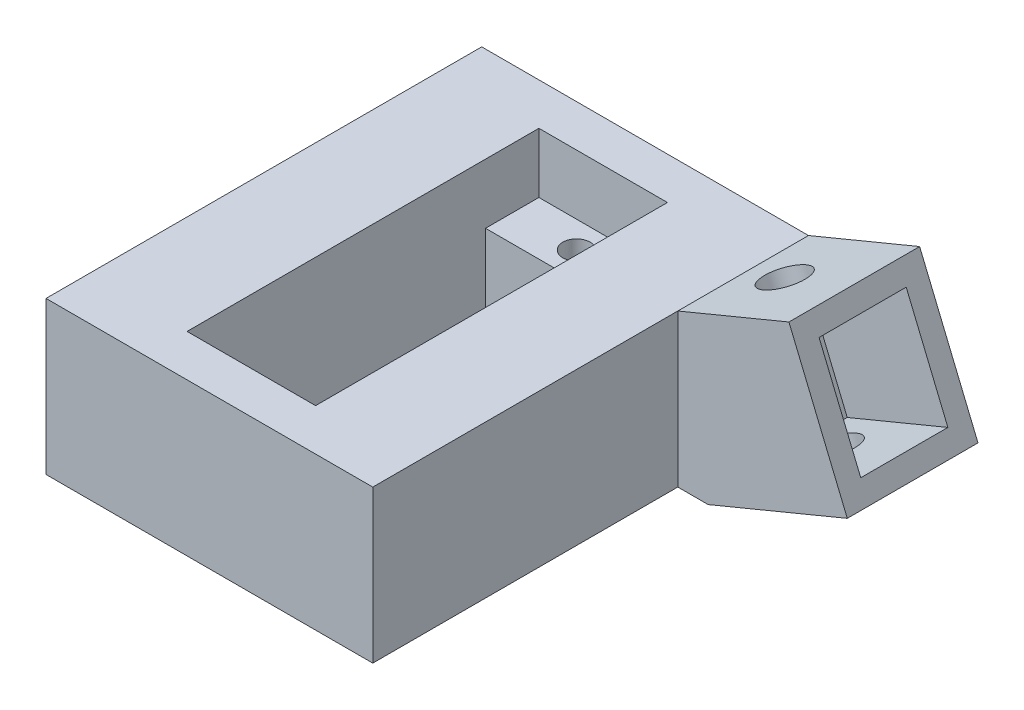
ISO-10303-21;
HEADER;
FILE_DESCRIPTION(('STEP AP214'),'2;1');
FILE_NAME('part.step','',(''),(''),'','','');
FILE_SCHEMA(('AUTOMOTIVE_DESIGN { 1 0 10303 214 1 1 1 1 }'));
ENDSEC;
DATA;
#1=APPLICATION_CONTEXT('core data for automotive mechanical design processes');
#2=APPLICATION_PROTOCOL_DEFINITION('international standard','automotive_design',2000,#1);
#3=PRODUCT_CONTEXT('',#1,'mechanical');
#4=PRODUCT('Part','Part','',(#3));
#5=PRODUCT_RELATED_PRODUCT_CATEGORY('part','',(#4));
#6=PRODUCT_DEFINITION_FORMATION('','',#4);
#7=PRODUCT_DEFINITION_CONTEXT('part definition',#1,'design');
#8=PRODUCT_DEFINITION('design','',#6,#7);
#9=PRODUCT_DEFINITION_SHAPE('','',#8);
#10=(LENGTH_UNIT() NAMED_UNIT(*) SI_UNIT(.MILLI.,.METRE.));
#11=(NAMED_UNIT(*) PLANE_ANGLE_UNIT() SI_UNIT($,.RADIAN.));
#12=(NAMED_UNIT(*) SI_UNIT($,.STERADIAN.) SOLID_ANGLE_UNIT());
#13=UNCERTAINTY_MEASURE_WITH_UNIT(LENGTH_MEASURE(1.E-05),#10,'distance_accuracy_value','');
#14=(GEOMETRIC_REPRESENTATION_CONTEXT(3) GLOBAL_UNCERTAINTY_ASSIGNED_CONTEXT((#13)) GLOBAL_UNIT_ASSIGNED_CONTEXT((#10,
#11,#12)) REPRESENTATION_CONTEXT('',''));
#15=CARTESIAN_POINT('',(0.,0.,0.));
#16=DIRECTION('',(0.,0.,1.));
#17=DIRECTION('',(1.,0.,0.));
#18=AXIS2_PLACEMENT_3D('',#15,#16,#17);
#19=CARTESIAN_POINT('',(0.,3.50358715260278,0.));
#20=DIRECTION('',(0.,1.,0.));
#21=DIRECTION('',(0.,0.,1.));
#22=AXIS2_PLACEMENT_3D('',#19,#20,#21);
#23=PLANE('',#22);
#24=CARTESIAN_POINT('',(-6.32904743494199,3.50358715260278,33.7));
#25=DIRECTION('',(0.,1.,0.));
#26=DIRECTION('',(0.,0.,1.));
#27=AXIS2_PLACEMENT_3D('',#24,#25,#26);
#28=CIRCLE('',#27,1.25);
#29=CARTESIAN_POINT('',(-6.32904743494199,3.50358715260278,34.95));
#30=VERTEX_POINT('',#29);
#31=EDGE_CURVE('E270',#30,#30,#28,.T.);
#32=ORIENTED_EDGE('',*,*,#31,.F.);
#33=EDGE_LOOP('',(#32));
#34=FACE_BOUND('',#33,.T.);
#35=DIRECTION('',(1.,0.,0.));
#36=VECTOR('',#35,1.);
#37=CARTESIAN_POINT('',(-12.229047434942,3.50358715260278,31.25));
#38=LINE('',#37,#36);
#39=CARTESIAN_POINT('',(-12.229047434942,3.50358715260278,31.25));
#40=VERTEX_POINT('',#39);
#41=CARTESIAN_POINT('',(-0.429047434941994,3.50358715260278,31.25));
#42=VERTEX_POINT('',#41);
#43=EDGE_CURVE('E275',#40,#42,#38,.T.);
#44=ORIENTED_EDGE('',*,*,#43,.F.);
#45=DIRECTION('',(0.,0.,1.));
#46=VECTOR('',#45,1.);
#47=CARTESIAN_POINT('',(-12.229047434942,3.50358715260278,3.85));
#48=LINE('',#47,#46);
#49=CARTESIAN_POINT('',(-12.229047434942,3.50358715260278,36.15));
#50=VERTEX_POINT('',#49);
#51=EDGE_CURVE('E328',#40,#50,#48,.T.);
#52=ORIENTED_EDGE('',*,*,#51,.T.);
#53=DIRECTION('',(1.,0.,0.));
#54=VECTOR('',#53,1.);
#55=CARTESIAN_POINT('',(-12.229047434942,3.50358715260278,36.15));
#56=LINE('',#55,#54);
#57=CARTESIAN_POINT('',(-0.429047434941994,3.50358715260278,36.15));
#58=VERTEX_POINT('',#57);
#59=EDGE_CURVE('E327',#50,#58,#56,.T.);
#60=ORIENTED_EDGE('',*,*,#59,.T.);
#61=DIRECTION('',(0.,0.,-1.));
#62=VECTOR('',#61,1.);
#63=CARTESIAN_POINT('',(-0.429047434941994,3.50358715260278,3.85));
#64=LINE('',#63,#62);
#65=EDGE_CURVE('E333',#58,#42,#64,.T.);
#66=ORIENTED_EDGE('',*,*,#65,.T.);
#67=EDGE_LOOP('',(#44,#52,#60,#66));
#68=FACE_BOUND('',#67,.T.);
#69=ADVANCED_FACE('F39',(#34,#68),#23,.T.);
#70=CARTESIAN_POINT('',(8.67095256505801,9.00358715260278,40.));
#71=DIRECTION('',(1.,0.,0.));
#72=DIRECTION('',(0.,0.,-1.));
#73=AXIS2_PLACEMENT_3D('',#70,#71,#72);
#74=PLANE('',#73);
#75=DIRECTION('',(0.,-1.,0.));
#76=VECTOR('',#75,1.);
#77=CARTESIAN_POINT('',(8.67095256505801,9.00358715260278,12.));
#78=LINE('',#77,#76);
#79=CARTESIAN_POINT('',(8.67095256505801,9.00358715260278,12.));
#80=VERTEX_POINT('',#79);
#81=CARTESIAN_POINT('',(8.67095256505801,-4.99526108798895,12.));
#82=VERTEX_POINT('',#81);
#83=EDGE_CURVE('E65',#80,#82,#78,.T.);
#84=ORIENTED_EDGE('',*,*,#83,.F.);
#85=DIRECTION('',(0.,0.,-1.));
#86=VECTOR('',#85,1.);
#87=CARTESIAN_POINT('',(8.67095256505801,9.00358715260278,40.));
#88=LINE('',#87,#86);
#89=CARTESIAN_POINT('',(8.67095256505801,9.00358715260278,40.));
#90=VERTEX_POINT('',#89);
#91=EDGE_CURVE('E11',#90,#80,#88,.T.);
#92=ORIENTED_EDGE('',*,*,#91,.F.);
#93=DIRECTION('',(0.,-1.,0.));
#94=VECTOR('',#93,1.);
#95=CARTESIAN_POINT('',(8.67095256505801,9.00358715260278,40.));
#96=LINE('',#95,#94);
#97=CARTESIAN_POINT('',(8.67095256505801,-4.99526108798895,40.));
#98=VERTEX_POINT('',#97);
#99=EDGE_CURVE('E369',#90,#98,#96,.T.);
#100=ORIENTED_EDGE('',*,*,#99,.T.);
#101=DIRECTION('',(0.,0.,-1.));
#102=VECTOR('',#101,1.);
#103=CARTESIAN_POINT('',(8.67095256505801,-4.99526108798895,40.));
#104=LINE('',#103,#102);
#105=EDGE_CURVE('E384',#98,#82,#104,.T.);
#106=ORIENTED_EDGE('',*,*,#105,.T.);
#107=EDGE_LOOP('',(#84,#92,#100,#106));
#108=FACE_BOUND('',#107,.T.);
#109=ADVANCED_FACE('F41',(#108),#74,.T.);
#110=CARTESIAN_POINT('',(8.67095256505801,9.00358715260278,40.));
#111=DIRECTION('',(0.,-1.,0.));
#112=DIRECTION('',(0.,0.,-1.));
#113=AXIS2_PLACEMENT_3D('',#110,#111,#112);
#114=PLANE('',#113);
#115=DIRECTION('',(1.,0.,0.));
#116=VECTOR('',#115,1.);
#117=CARTESIAN_POINT('',(-12.229047434942,9.00358715260278,36.15));
#118=LINE('',#117,#116);
#119=CARTESIAN_POINT('',(-12.229047434942,9.00358715260278,36.15));
#120=VERTEX_POINT('',#119);
#121=CARTESIAN_POINT('',(-0.429047434941994,9.00358715260278,36.15));
#122=VERTEX_POINT('',#121);
#123=EDGE_CURVE('E344',#120,#122,#118,.T.);
#124=ORIENTED_EDGE('',*,*,#123,.F.);
#125=DIRECTION('',(0.,0.,1.));
#126=VECTOR('',#125,1.);
#127=CARTESIAN_POINT('',(-12.229047434942,9.00358715260278,3.85));
#128=LINE('',#127,#126);
#129=CARTESIAN_POINT('',(-12.229047434942,9.00358715260278,3.85));
#130=VERTEX_POINT('',#129);
#131=EDGE_CURVE('E314',#130,#120,#128,.T.);
#132=ORIENTED_EDGE('',*,*,#131,.F.);
#133=DIRECTION('',(-1.,0.,0.));
#134=VECTOR('',#133,1.);
#135=CARTESIAN_POINT('',(-12.229047434942,9.00358715260278,3.85));
#136=LINE('',#135,#134);
#137=CARTESIAN_POINT('',(-0.429047434941994,9.00358715260278,3.85));
#138=VERTEX_POINT('',#137);
#139=EDGE_CURVE('E352',#138,#130,#136,.T.);
#140=ORIENTED_EDGE('',*,*,#139,.F.);
#141=DIRECTION('',(0.,0.,-1.));
#142=VECTOR('',#141,1.);
#143=CARTESIAN_POINT('',(-0.429047434941994,9.00358715260278,3.85));
#144=LINE('',#143,#142);
#145=EDGE_CURVE('E348',#122,#138,#144,.T.);
#146=ORIENTED_EDGE('',*,*,#145,.F.);
#147=EDGE_LOOP('',(#124,#132,#140,#146));
#148=FACE_BOUND('',#147,.T.);
#149=DIRECTION('',(-1.,0.,0.));
#150=VECTOR('',#149,1.);
#151=CARTESIAN_POINT('',(8.67095256505801,9.00358715260278,0.));
#152=LINE('',#151,#150);
#153=CARTESIAN_POINT('',(8.67095256505801,9.00358715260278,0.));
#154=VERTEX_POINT('',#153);
#155=CARTESIAN_POINT('',(-21.329047434942,9.00358715260278,0.));
#156=VERTEX_POINT('',#155);
#157=EDGE_CURVE('E374',#154,#156,#152,.T.);
#158=ORIENTED_EDGE('',*,*,#157,.T.);
#159=DIRECTION('',(0.,0.,-1.));
#160=VECTOR('',#159,1.);
#161=CARTESIAN_POINT('',(-21.329047434942,9.00358715260278,40.));
#162=LINE('',#161,#160);
#163=CARTESIAN_POINT('',(-21.329047434942,9.00358715260278,40.));
#164=VERTEX_POINT('',#163);
#165=EDGE_CURVE('E49',#164,#156,#162,.T.);
#166=ORIENTED_EDGE('',*,*,#165,.F.);
#167=DIRECTION('',(-1.,0.,0.));
#168=VECTOR('',#167,1.);
#169=CARTESIAN_POINT('',(-11.329047434942,9.00358715260278,40.));
#170=LINE('',#169,#168);
#171=EDGE_CURVE('E381',#90,#164,#170,.T.);
#172=ORIENTED_EDGE('',*,*,#171,.F.);
#173=ORIENTED_EDGE('',*,*,#91,.T.);
#174=DIRECTION('',(0.,0.,-1.));
#175=VECTOR('',#174,1.);
#176=CARTESIAN_POINT('',(8.67095256505801,9.00358715260278,12.));
#177=LINE('',#176,#175);
#178=EDGE_CURVE('E267',#80,#154,#177,.T.);
#179=ORIENTED_EDGE('',*,*,#178,.T.);
#180=EDGE_LOOP('',(#158,#166,#172,#173,#179));
#181=FACE_BOUND('',#180,.T.);
#182=ADVANCED_FACE('F424',(#148,#181),#114,.F.);
#183=CARTESIAN_POINT('',(-21.329047434942,9.00358715260278,40.));
#184=DIRECTION('',(1.,0.,0.));
#185=DIRECTION('',(0.,0.,-1.));
#186=AXIS2_PLACEMENT_3D('',#183,#184,#185);
#187=PLANE('',#186);
#188=DIRECTION('',(0.,-1.,0.));
#189=VECTOR('',#188,1.);
#190=CARTESIAN_POINT('',(-21.329047434942,9.00358715260278,0.));
#191=LINE('',#190,#189);
#192=CARTESIAN_POINT('',(-21.329047434942,-4.99526108798895,0.));
#193=VERTEX_POINT('',#192);
#194=EDGE_CURVE('E387',#156,#193,#191,.T.);
#195=ORIENTED_EDGE('',*,*,#194,.T.);
#196=DIRECTION('',(0.,0.,-1.));
#197=VECTOR('',#196,1.);
#198=CARTESIAN_POINT('',(-21.329047434942,-4.99526108798895,40.));
#199=LINE('',#198,#197);
#200=CARTESIAN_POINT('',(-21.329047434942,-4.99526108798895,40.));
#201=VERTEX_POINT('',#200);
#202=EDGE_CURVE('E395',#201,#193,#199,.T.);
#203=ORIENTED_EDGE('',*,*,#202,.F.);
#204=DIRECTION('',(0.,-1.,0.));
#205=VECTOR('',#204,1.);
#206=CARTESIAN_POINT('',(-21.329047434942,9.00358715260278,40.));
#207=LINE('',#206,#205);
#208=EDGE_CURVE('E377',#164,#201,#207,.T.);
#209=ORIENTED_EDGE('',*,*,#208,.F.);
#210=ORIENTED_EDGE('',*,*,#165,.T.);
#211=EDGE_LOOP('',(#195,#203,#209,#210));
#212=FACE_BOUND('',#211,.T.);
#213=ADVANCED_FACE('F431',(#212),#187,.F.);
#214=CARTESIAN_POINT('',(-21.329047434942,-4.99526108798895,40.));
#215=DIRECTION('',(0.,1.,0.));
#216=DIRECTION('',(0.,0.,1.));
#217=AXIS2_PLACEMENT_3D('',#214,#215,#216);
#218=PLANE('',#217);
#219=CARTESIAN_POINT('',(-6.329047434942,-4.99526108798895,6.3));
#220=DIRECTION('',(0.,1.,0.));
#221=DIRECTION('',(0.,0.,1.));
#222=AXIS2_PLACEMENT_3D('',#219,#220,#221);
#223=CIRCLE('',#222,1.25);
#224=CARTESIAN_POINT('',(-6.329047434942,-4.99526108798895,7.55));
#225=VERTEX_POINT('',#224);
#226=EDGE_CURVE('E271',#225,#225,#223,.T.);
#227=ORIENTED_EDGE('',*,*,#226,.T.);
#228=EDGE_LOOP('',(#227));
#229=FACE_BOUND('',#228,.T.);
#230=CARTESIAN_POINT('',(-6.32904743494199,-4.99526108798895,33.7));
#231=DIRECTION('',(0.,1.,0.));
#232=DIRECTION('',(0.,0.,1.));
#233=AXIS2_PLACEMENT_3D('',#230,#231,#232);
#234=CIRCLE('',#233,1.25);
#235=CARTESIAN_POINT('',(-6.32904743494199,-4.99526108798895,34.95));
#236=VERTEX_POINT('',#235);
#237=EDGE_CURVE('E280',#236,#236,#234,.T.);
#238=ORIENTED_EDGE('',*,*,#237,.T.);
#239=EDGE_LOOP('',(#238));
#240=FACE_BOUND('',#239,.T.);
#241=DIRECTION('',(-1.,0.,0.));
#242=VECTOR('',#241,1.);
#243=CARTESIAN_POINT('',(-12.229047434942,-4.99526108798895,8.75));
#244=LINE('',#243,#242);
#245=CARTESIAN_POINT('',(-0.429047434941994,-4.99526108798895,8.75));
#246=VERTEX_POINT('',#245);
#247=CARTESIAN_POINT('',(-12.229047434942,-4.99526108798895,8.75));
#248=VERTEX_POINT('',#247);
#249=EDGE_CURVE('E300',#246,#248,#244,.T.);
#250=ORIENTED_EDGE('',*,*,#249,.T.);
#251=DIRECTION('',(0.,0.,1.));
#252=VECTOR('',#251,1.);
#253=CARTESIAN_POINT('',(-12.229047434942,-4.99526108798895,8.75));
#254=LINE('',#253,#252);
#255=CARTESIAN_POINT('',(-12.229047434942,-4.99526108798895,31.25));
#256=VERTEX_POINT('',#255);
#257=EDGE_CURVE('E287',#248,#256,#254,.T.);
#258=ORIENTED_EDGE('',*,*,#257,.T.);
#259=DIRECTION('',(1.,0.,0.));
#260=VECTOR('',#259,1.);
#261=CARTESIAN_POINT('',(-12.229047434942,-4.99526108798895,31.25));
#262=LINE('',#261,#260);
#263=CARTESIAN_POINT('',(-0.429047434941994,-4.99526108798895,31.25));
#264=VERTEX_POINT('',#263);
#265=EDGE_CURVE('E291',#256,#264,#262,.T.);
#266=ORIENTED_EDGE('',*,*,#265,.T.);
#267=DIRECTION('',(0.,0.,-1.));
#268=VECTOR('',#267,1.);
#269=CARTESIAN_POINT('',(-0.429047434941994,-4.99526108798895,8.75));
#270=LINE('',#269,#268);
#271=EDGE_CURVE('E296',#264,#246,#270,.T.);
#272=ORIENTED_EDGE('',*,*,#271,.T.);
#273=EDGE_LOOP('',(#250,#258,#266,#272));
#274=FACE_BOUND('',#273,.T.);
#275=DIRECTION('',(1.,0.,0.));
#276=VECTOR('',#275,1.);
#277=CARTESIAN_POINT('',(-21.329047434942,-4.99526108798895,0.));
#278=LINE('',#277,#276);
#279=CARTESIAN_POINT('',(11.458506301557,-4.99526108798895,0.));
#280=VERTEX_POINT('',#279);
#281=EDGE_CURVE('E359',#193,#280,#278,.T.);
#282=ORIENTED_EDGE('',*,*,#281,.T.);
#283=DIRECTION('',(0.,0.,-1.));
#284=VECTOR('',#283,1.);
#285=CARTESIAN_POINT('',(11.458506301557,-4.99526108798895,12.));
#286=LINE('',#285,#284);
#287=CARTESIAN_POINT('',(11.458506301557,-4.99526108798895,12.));
#288=VERTEX_POINT('',#287);
#289=EDGE_CURVE('E263',#288,#280,#286,.T.);
#290=ORIENTED_EDGE('',*,*,#289,.F.);
#291=DIRECTION('',(1.,0.,0.));
#292=VECTOR('',#291,1.);
#293=CARTESIAN_POINT('',(11.458506301557,-4.99526108798895,12.));
#294=LINE('',#293,#292);
#295=EDGE_CURVE('E237',#82,#288,#294,.T.);
#296=ORIENTED_EDGE('',*,*,#295,.F.);
#297=ORIENTED_EDGE('',*,*,#105,.F.);
#298=DIRECTION('',(1.,0.,0.));
#299=VECTOR('',#298,1.);
#300=CARTESIAN_POINT('',(-11.329047434942,-4.99526108798895,40.));
#301=LINE('',#300,#299);
#302=EDGE_CURVE('E373',#201,#98,#301,.T.);
#303=ORIENTED_EDGE('',*,*,#302,.F.);
#304=ORIENTED_EDGE('',*,*,#202,.T.);
#305=EDGE_LOOP('',(#282,#290,#296,#297,#303,#304));
#306=FACE_BOUND('',#305,.T.);
#307=ADVANCED_FACE('F408',(#229,#240,#274,#306),#218,.F.);
#308=CARTESIAN_POINT('',(0.,0.,40.));
#309=DIRECTION('',(0.,0.,1.));
#310=DIRECTION('',(1.,0.,0.));
#311=AXIS2_PLACEMENT_3D('',#308,#309,#310);
#312=PLANE('',#311);
#313=ORIENTED_EDGE('',*,*,#99,.F.);
#314=ORIENTED_EDGE('',*,*,#171,.T.);
#315=ORIENTED_EDGE('',*,*,#208,.T.);
#316=ORIENTED_EDGE('',*,*,#302,.T.);
#317=EDGE_LOOP('',(#313,#314,#315,#316));
#318=FACE_BOUND('',#317,.T.);
#319=ADVANCED_FACE('F434',(#318),#312,.T.);
#320=CARTESIAN_POINT('',(0.,0.,0.));
#321=DIRECTION('',(0.,0.,1.));
#322=DIRECTION('',(1.,0.,0.));
#323=AXIS2_PLACEMENT_3D('',#320,#321,#322);
#324=PLANE('',#323);
#325=ORIENTED_EDGE('',*,*,#157,.F.);
#326=DIRECTION('',(-0.923879532511285,-0.382683432365093,0.));
#327=VECTOR('',#326,1.);
#328=CARTESIAN_POINT('',(18.8738723196785,13.229774890771,0.));
#329=LINE('',#328,#327);
#330=CARTESIAN_POINT('',(18.8738723196785,13.229774890771,0.));
#331=VERTEX_POINT('',#330);
#332=EDGE_CURVE('E224',#331,#154,#329,.T.);
#333=ORIENTED_EDGE('',*,*,#332,.F.);
#334=DIRECTION('',(-0.382683432365093,0.923879532511286,0.));
#335=VECTOR('',#334,1.);
#336=CARTESIAN_POINT('',(20.7872894815039,8.61037722821456,0.));
#337=LINE('',#336,#335);
#338=CARTESIAN_POINT('',(24.2314403727898,0.295461435612971,0.));
#339=VERTEX_POINT('',#338);
#340=EDGE_CURVE('E234',#339,#331,#337,.T.);
#341=ORIENTED_EDGE('',*,*,#340,.F.);
#342=DIRECTION('',(0.923879532511289,0.382683432365084,0.));
#343=VECTOR('',#342,1.);
#344=CARTESIAN_POINT('',(24.2314403727898,0.295461435612971,0.));
#345=LINE('',#344,#343);
#346=EDGE_CURVE('E250',#280,#339,#345,.T.);
#347=ORIENTED_EDGE('',*,*,#346,.F.);
#348=ORIENTED_EDGE('',*,*,#281,.F.);
#349=ORIENTED_EDGE('',*,*,#194,.F.);
#350=EDGE_LOOP('',(#325,#333,#341,#347,#348,#349));
#351=FACE_BOUND('',#350,.T.);
#352=ADVANCED_FACE('F428',(#351),#324,.F.);
#353=CARTESIAN_POINT('',(-12.229047434942,3.50358715260278,3.85));
#354=DIRECTION('',(-1.,0.,0.));
#355=DIRECTION('',(0.,0.,1.));
#356=AXIS2_PLACEMENT_3D('',#353,#354,#355);
#357=PLANE('',#356);
#358=ORIENTED_EDGE('',*,*,#131,.T.);
#359=DIRECTION('',(0.,1.,0.));
#360=VECTOR('',#359,1.);
#361=CARTESIAN_POINT('',(-12.229047434942,3.50358715260278,36.15));
#362=LINE('',#361,#360);
#363=EDGE_CURVE('E341',#50,#120,#362,.T.);
#364=ORIENTED_EDGE('',*,*,#363,.F.);
#365=ORIENTED_EDGE('',*,*,#51,.F.);
#366=DIRECTION('',(0.,1.,0.));
#367=VECTOR('',#366,1.);
#368=CARTESIAN_POINT('',(-12.229047434942,-4.99526108798895,31.25));
#369=LINE('',#368,#367);
#370=EDGE_CURVE('E304',#256,#40,#369,.T.);
#371=ORIENTED_EDGE('',*,*,#370,.F.);
#372=ORIENTED_EDGE('',*,*,#257,.F.);
#373=DIRECTION('',(0.,1.,0.));
#374=VECTOR('',#373,1.);
#375=CARTESIAN_POINT('',(-12.229047434942,-4.99526108798895,8.75));
#376=LINE('',#375,#374);
#377=CARTESIAN_POINT('',(-12.229047434942,3.50358715260278,8.75));
#378=VERTEX_POINT('',#377);
#379=EDGE_CURVE('E311',#248,#378,#376,.T.);
#380=ORIENTED_EDGE('',*,*,#379,.T.);
#381=CARTESIAN_POINT('',(-12.229047434942,3.50358715260278,3.85));
#382=VERTEX_POINT('',#381);
#383=EDGE_CURVE('E323',#382,#378,#48,.T.);
#384=ORIENTED_EDGE('',*,*,#383,.F.);
#385=DIRECTION('',(0.,1.,0.));
#386=VECTOR('',#385,1.);
#387=CARTESIAN_POINT('',(-12.229047434942,3.50358715260278,3.85));
#388=LINE('',#387,#386);
#389=EDGE_CURVE('E356',#382,#130,#388,.T.);
#390=ORIENTED_EDGE('',*,*,#389,.T.);
#391=EDGE_LOOP('',(#358,#364,#365,#371,#372,#380,#384,#390));
#392=FACE_BOUND('',#391,.T.);
#393=ADVANCED_FACE('F442',(#392),#357,.F.);
#394=CARTESIAN_POINT('',(-12.229047434942,3.50358715260278,3.85));
#395=DIRECTION('',(0.,0.,-1.));
#396=DIRECTION('',(-1.,0.,0.));
#397=AXIS2_PLACEMENT_3D('',#394,#395,#396);
#398=PLANE('',#397);
#399=ORIENTED_EDGE('',*,*,#139,.T.);
#400=ORIENTED_EDGE('',*,*,#389,.F.);
#401=DIRECTION('',(-1.,0.,0.));
#402=VECTOR('',#401,1.);
#403=CARTESIAN_POINT('',(-12.229047434942,3.50358715260278,3.85));
#404=LINE('',#403,#402);
#405=CARTESIAN_POINT('',(-0.429047434941994,3.50358715260278,3.85));
#406=VERTEX_POINT('',#405);
#407=EDGE_CURVE('E337',#406,#382,#404,.T.);
#408=ORIENTED_EDGE('',*,*,#407,.F.);
#409=DIRECTION('',(0.,1.,0.));
#410=VECTOR('',#409,1.);
#411=CARTESIAN_POINT('',(-0.429047434941994,3.50358715260278,3.85));
#412=LINE('',#411,#410);
#413=EDGE_CURVE('E360',#406,#138,#412,.T.);
#414=ORIENTED_EDGE('',*,*,#413,.T.);
#415=EDGE_LOOP('',(#399,#400,#408,#414));
#416=FACE_BOUND('',#415,.T.);
#417=ADVANCED_FACE('F497',(#416),#398,.F.);
#418=CARTESIAN_POINT('',(-0.429047434941994,3.50358715260278,3.85));
#419=DIRECTION('',(1.,0.,0.));
#420=DIRECTION('',(0.,0.,-1.));
#421=AXIS2_PLACEMENT_3D('',#418,#419,#420);
#422=PLANE('',#421);
#423=ORIENTED_EDGE('',*,*,#145,.T.);
#424=ORIENTED_EDGE('',*,*,#413,.F.);
#425=CARTESIAN_POINT('',(-0.429047434941994,3.50358715260278,8.75));
#426=VERTEX_POINT('',#425);
#427=EDGE_CURVE('E332',#426,#406,#64,.T.);
#428=ORIENTED_EDGE('',*,*,#427,.F.);
#429=DIRECTION('',(0.,1.,0.));
#430=VECTOR('',#429,1.);
#431=CARTESIAN_POINT('',(-0.429047434941994,-4.99526108798895,8.75));
#432=LINE('',#431,#430);
#433=EDGE_CURVE('E315',#246,#426,#432,.T.);
#434=ORIENTED_EDGE('',*,*,#433,.F.);
#435=ORIENTED_EDGE('',*,*,#271,.F.);
#436=DIRECTION('',(0.,1.,0.));
#437=VECTOR('',#436,1.);
#438=CARTESIAN_POINT('',(-0.429047434941994,-4.99526108798895,31.25));
#439=LINE('',#438,#437);
#440=EDGE_CURVE('E318',#264,#42,#439,.T.);
#441=ORIENTED_EDGE('',*,*,#440,.T.);
#442=ORIENTED_EDGE('',*,*,#65,.F.);
#443=DIRECTION('',(0.,1.,0.));
#444=VECTOR('',#443,1.);
#445=CARTESIAN_POINT('',(-0.429047434941994,3.50358715260278,36.15));
#446=LINE('',#445,#444);
#447=EDGE_CURVE('E363',#58,#122,#446,.T.);
#448=ORIENTED_EDGE('',*,*,#447,.T.);
#449=EDGE_LOOP('',(#423,#424,#428,#434,#435,#441,#442,#448));
#450=FACE_BOUND('',#449,.T.);
#451=ADVANCED_FACE('F468',(#450),#422,.F.);
#452=CARTESIAN_POINT('',(-12.229047434942,3.50358715260278,36.15));
#453=DIRECTION('',(0.,0.,1.));
#454=DIRECTION('',(1.,0.,0.));
#455=AXIS2_PLACEMENT_3D('',#452,#453,#454);
#456=PLANE('',#455);
#457=ORIENTED_EDGE('',*,*,#123,.T.);
#458=ORIENTED_EDGE('',*,*,#447,.F.);
#459=ORIENTED_EDGE('',*,*,#59,.F.);
#460=ORIENTED_EDGE('',*,*,#363,.T.);
#461=EDGE_LOOP('',(#457,#458,#459,#460));
#462=FACE_BOUND('',#461,.T.);
#463=ADVANCED_FACE('F459',(#462),#456,.F.);
#464=CARTESIAN_POINT('',(-6.329047434942,3.50358715260278,6.3));
#465=DIRECTION('',(0.,1.,0.));
#466=DIRECTION('',(0.,0.,1.));
#467=AXIS2_PLACEMENT_3D('',#464,#465,#466);
#468=CIRCLE('',#467,1.25);
#469=CARTESIAN_POINT('',(-6.329047434942,3.50358715260278,7.55));
#470=VERTEX_POINT('',#469);
#471=EDGE_CURVE('E276',#470,#470,#468,.T.);
#472=ORIENTED_EDGE('',*,*,#471,.F.);
#473=EDGE_LOOP('',(#472));
#474=FACE_BOUND('',#473,.T.);
#475=DIRECTION('',(-1.,0.,0.));
#476=VECTOR('',#475,1.);
#477=CARTESIAN_POINT('',(-12.229047434942,3.50358715260278,8.75));
#478=LINE('',#477,#476);
#479=EDGE_CURVE('E292',#426,#378,#478,.T.);
#480=ORIENTED_EDGE('',*,*,#479,.F.);
#481=ORIENTED_EDGE('',*,*,#427,.T.);
#482=ORIENTED_EDGE('',*,*,#407,.T.);
#483=ORIENTED_EDGE('',*,*,#383,.T.);
#484=EDGE_LOOP('',(#480,#481,#482,#483));
#485=FACE_BOUND('',#484,.T.);
#486=ADVANCED_FACE('F449',(#474,#485),#23,.T.);
#487=CARTESIAN_POINT('',(-12.229047434942,-4.99526108798895,8.75));
#488=DIRECTION('',(0.,0.,-1.));
#489=DIRECTION('',(-1.,0.,0.));
#490=AXIS2_PLACEMENT_3D('',#487,#488,#489);
#491=PLANE('',#490);
#492=ORIENTED_EDGE('',*,*,#479,.T.);
#493=ORIENTED_EDGE('',*,*,#379,.F.);
#494=ORIENTED_EDGE('',*,*,#249,.F.);
#495=ORIENTED_EDGE('',*,*,#433,.T.);
#496=EDGE_LOOP('',(#492,#493,#494,#495));
#497=FACE_BOUND('',#496,.T.);
#498=ADVANCED_FACE('F458',(#497),#491,.F.);
#499=CARTESIAN_POINT('',(-12.229047434942,-4.99526108798895,31.25));
#500=DIRECTION('',(0.,0.,1.));
#501=DIRECTION('',(1.,0.,0.));
#502=AXIS2_PLACEMENT_3D('',#499,#500,#501);
#503=PLANE('',#502);
#504=ORIENTED_EDGE('',*,*,#43,.T.);
#505=ORIENTED_EDGE('',*,*,#440,.F.);
#506=ORIENTED_EDGE('',*,*,#265,.F.);
#507=ORIENTED_EDGE('',*,*,#370,.T.);
#508=EDGE_LOOP('',(#504,#505,#506,#507));
#509=FACE_BOUND('',#508,.T.);
#510=ADVANCED_FACE('F465',(#509),#503,.F.);
#511=CARTESIAN_POINT('',(-6.329047434942,-4.99526108798895,6.3));
#512=DIRECTION('',(0.,1.,0.));
#513=DIRECTION('',(0.,0.,1.));
#514=AXIS2_PLACEMENT_3D('',#511,#512,#513);
#515=CYLINDRICAL_SURFACE('',#514,1.25);
#516=ORIENTED_EDGE('',*,*,#226,.F.);
#517=EDGE_LOOP('',(#516));
#518=FACE_BOUND('',#517,.T.);
#519=ORIENTED_EDGE('',*,*,#471,.T.);
#520=EDGE_LOOP('',(#519));
#521=FACE_BOUND('',#520,.T.);
#522=ADVANCED_FACE('F527',(#518,#521),#515,.F.);
#523=CARTESIAN_POINT('',(-6.32904743494199,-4.99526108798895,33.7));
#524=DIRECTION('',(0.,1.,0.));
#525=DIRECTION('',(0.,0.,1.));
#526=AXIS2_PLACEMENT_3D('',#523,#524,#525);
#527=CYLINDRICAL_SURFACE('',#526,1.25);
#528=ORIENTED_EDGE('',*,*,#237,.F.);
#529=EDGE_LOOP('',(#528));
#530=FACE_BOUND('',#529,.T.);
#531=ORIENTED_EDGE('',*,*,#31,.T.);
#532=EDGE_LOOP('',(#531));
#533=FACE_BOUND('',#532,.T.);
#534=ADVANCED_FACE('F522',(#530,#533),#527,.F.);
#535=CARTESIAN_POINT('',(18.8738723196785,13.229774890771,12.));
#536=DIRECTION('',(0.382683432365093,-0.923879532511285,0.));
#537=DIRECTION('',(0.923879532511286,0.382683432365093,0.));
#538=AXIS2_PLACEMENT_3D('',#535,#536,#537);
#539=PLANE('',#538);
#540=CARTESIAN_POINT('',(12.4874052840622,10.58441362897,6.));
#541=DIRECTION('',(0.382683432365093,-0.923879532511285,0.));
#542=DIRECTION('',(0.923879532511286,0.382683432365093,0.));
#543=AXIS2_PLACEMENT_3D('',#540,#541,#542);
#544=CIRCLE('',#543,2.);
#545=CARTESIAN_POINT('',(14.3351643490848,11.3497804937002,6.));
#546=VERTEX_POINT('',#545);
#547=EDGE_CURVE('E206',#546,#546,#544,.T.);
#548=ORIENTED_EDGE('',*,*,#547,.T.);
#549=EDGE_LOOP('',(#548));
#550=FACE_BOUND('',#549,.T.);
#551=ORIENTED_EDGE('',*,*,#332,.T.);
#552=ORIENTED_EDGE('',*,*,#178,.F.);
#553=DIRECTION('',(-0.923879532511285,-0.382683432365093,0.));
#554=VECTOR('',#553,1.);
#555=CARTESIAN_POINT('',(18.8738723196785,13.229774890771,12.));
#556=LINE('',#555,#554);
#557=CARTESIAN_POINT('',(18.8738723196785,13.229774890771,12.));
#558=VERTEX_POINT('',#557);
#559=EDGE_CURVE('E230',#558,#80,#556,.T.);
#560=ORIENTED_EDGE('',*,*,#559,.F.);
#561=DIRECTION('',(0.,0.,-1.));
#562=VECTOR('',#561,1.);
#563=CARTESIAN_POINT('',(18.8738723196785,13.229774890771,12.));
#564=LINE('',#563,#562);
#565=EDGE_CURVE('E246',#558,#331,#564,.T.);
#566=ORIENTED_EDGE('',*,*,#565,.T.);
#567=EDGE_LOOP('',(#551,#552,#560,#566));
#568=FACE_BOUND('',#567,.T.);
#569=ADVANCED_FACE('F421',(#550,#568),#539,.F.);
#570=CARTESIAN_POINT('',(24.2314403727898,0.295461435612971,12.));
#571=DIRECTION('',(-0.382683432365084,0.923879532511289,0.));
#572=DIRECTION('',(-0.923879532511289,-0.382683432365084,0.));
#573=AXIS2_PLACEMENT_3D('',#570,#571,#572);
#574=PLANE('',#573);
#575=CARTESIAN_POINT('',(17.8449733371734,-2.34989982618799,6.));
#576=DIRECTION('',(0.382683432365084,-0.923879532511289,0.));
#577=DIRECTION('',(0.923879532511289,0.382683432365084,0.));
#578=AXIS2_PLACEMENT_3D('',#575,#576,#577);
#579=CIRCLE('',#578,2.);
#580=CARTESIAN_POINT('',(19.692732402196,-1.58453296145782,6.));
#581=VERTEX_POINT('',#580);
#582=EDGE_CURVE('E725',#581,#581,#579,.T.);
#583=ORIENTED_EDGE('',*,*,#582,.F.);
#584=EDGE_LOOP('',(#583));
#585=FACE_BOUND('',#584,.T.);
#586=ORIENTED_EDGE('',*,*,#346,.T.);
#587=DIRECTION('',(0.,0.,-1.));
#588=VECTOR('',#587,1.);
#589=CARTESIAN_POINT('',(24.2314403727898,0.295461435612971,12.));
#590=LINE('',#589,#588);
#591=CARTESIAN_POINT('',(24.2314403727898,0.295461435612971,12.));
#592=VERTEX_POINT('',#591);
#593=EDGE_CURVE('E259',#592,#339,#590,.T.);
#594=ORIENTED_EDGE('',*,*,#593,.F.);
#595=DIRECTION('',(0.923879532511289,0.382683432365084,0.));
#596=VECTOR('',#595,1.);
#597=CARTESIAN_POINT('',(24.2314403727898,0.295461435612971,12.));
#598=LINE('',#597,#596);
#599=EDGE_CURVE('E240',#288,#592,#598,.T.);
#600=ORIENTED_EDGE('',*,*,#599,.F.);
#601=ORIENTED_EDGE('',*,*,#289,.T.);
#602=EDGE_LOOP('',(#586,#594,#600,#601));
#603=FACE_BOUND('',#602,.T.);
#604=ADVANCED_FACE('F414',(#585,#603),#574,.F.);
#605=CARTESIAN_POINT('',(20.7872894815039,8.61037722821456,12.));
#606=DIRECTION('',(-0.923879532511285,-0.382683432365093,0.));
#607=DIRECTION('',(0.382683432365093,-0.923879532511286,0.));
#608=AXIS2_PLACEMENT_3D('',#605,#606,#607);
#609=PLANE('',#608);
#610=DIRECTION('',(0.,0.,-1.));
#611=VECTOR('',#610,1.);
#612=CARTESIAN_POINT('',(23.4660735080596,2.14322050063554,10.));
#613=LINE('',#612,#611);
#614=CARTESIAN_POINT('',(23.4660735080596,2.14322050063554,10.));
#615=VERTEX_POINT('',#614);
#616=CARTESIAN_POINT('',(23.4660735080596,2.14322050063554,2.));
#617=VERTEX_POINT('',#616);
#618=EDGE_CURVE('E215',#615,#617,#613,.T.);
#619=ORIENTED_EDGE('',*,*,#618,.F.);
#620=DIRECTION('',(0.382683432365093,-0.923879532511286,0.));
#621=VECTOR('',#620,1.);
#622=CARTESIAN_POINT('',(19.6392391844087,11.3820158257484,10.));
#623=LINE('',#622,#621);
#624=CARTESIAN_POINT('',(19.6392391844087,11.3820158257484,10.));
#625=VERTEX_POINT('',#624);
#626=EDGE_CURVE('E57',#625,#615,#623,.T.);
#627=ORIENTED_EDGE('',*,*,#626,.F.);
#628=DIRECTION('',(0.,0.,1.));
#629=VECTOR('',#628,1.);
#630=CARTESIAN_POINT('',(19.6392391844087,11.3820158257484,10.));
#631=LINE('',#630,#629);
#632=CARTESIAN_POINT('',(19.6392391844087,11.3820158257484,2.));
#633=VERTEX_POINT('',#632);
#634=EDGE_CURVE('E199',#633,#625,#631,.T.);
#635=ORIENTED_EDGE('',*,*,#634,.F.);
#636=DIRECTION('',(-0.382683432365093,0.923879532511286,0.));
#637=VECTOR('',#636,1.);
#638=CARTESIAN_POINT('',(19.6392391844087,11.3820158257484,2.));
#639=LINE('',#638,#637);
#640=EDGE_CURVE('E203',#617,#633,#639,.T.);
#641=ORIENTED_EDGE('',*,*,#640,.F.);
#642=EDGE_LOOP('',(#619,#627,#635,#641));
#643=FACE_BOUND('',#642,.T.);
#644=ORIENTED_EDGE('',*,*,#340,.T.);
#645=ORIENTED_EDGE('',*,*,#565,.F.);
#646=DIRECTION('',(-0.382683432365093,0.923879532511285,0.));
#647=VECTOR('',#646,1.);
#648=CARTESIAN_POINT('',(20.7872894815039,8.61037722821456,12.));
#649=LINE('',#648,#647);
#650=EDGE_CURVE('E243',#592,#558,#649,.T.);
#651=ORIENTED_EDGE('',*,*,#650,.F.);
#652=ORIENTED_EDGE('',*,*,#593,.T.);
#653=EDGE_LOOP('',(#644,#645,#651,#652));
#654=FACE_BOUND('',#653,.T.);
#655=ADVANCED_FACE('F418',(#643,#654),#609,.F.);
#656=CARTESIAN_POINT('',(0.,0.,12.));
#657=DIRECTION('',(0.,0.,1.));
#658=DIRECTION('',(1.,0.,0.));
#659=AXIS2_PLACEMENT_3D('',#656,#657,#658);
#660=PLANE('',#659);
#661=ORIENTED_EDGE('',*,*,#559,.T.);
#662=ORIENTED_EDGE('',*,*,#83,.T.);
#663=ORIENTED_EDGE('',*,*,#295,.T.);
#664=ORIENTED_EDGE('',*,*,#599,.T.);
#665=ORIENTED_EDGE('',*,*,#650,.T.);
#666=EDGE_LOOP('',(#661,#662,#663,#664,#665));
#667=FACE_BOUND('',#666,.T.);
#668=ADVANCED_FACE('F404',(#667),#660,.T.);
#669=CARTESIAN_POINT('',(10.4004438592958,7.55518150209749,10.));
#670=DIRECTION('',(0.,0.,1.));
#671=DIRECTION('',(0.,-1.,0.));
#672=AXIS2_PLACEMENT_3D('',#669,#670,#671);
#673=PLANE('',#672);
#674=ORIENTED_EDGE('',*,*,#626,.T.);
#675=DIRECTION('',(0.923879532511286,0.382683432365093,0.));
#676=VECTOR('',#675,1.);
#677=CARTESIAN_POINT('',(14.2272781829467,-1.68361382301538,10.));
#678=LINE('',#677,#676);
#679=CARTESIAN_POINT('',(14.2272781829467,-1.68361382301538,10.));
#680=VERTEX_POINT('',#679);
#681=EDGE_CURVE('E174',#680,#615,#678,.T.);
#682=ORIENTED_EDGE('',*,*,#681,.F.);
#683=DIRECTION('',(0.382683432365093,-0.923879532511286,0.));
#684=VECTOR('',#683,1.);
#685=CARTESIAN_POINT('',(10.4004438592958,7.55518150209749,10.));
#686=LINE('',#685,#684);
#687=CARTESIAN_POINT('',(10.4004438592958,7.55518150209749,10.));
#688=VERTEX_POINT('',#687);
#689=EDGE_CURVE('E178',#688,#680,#686,.T.);
#690=ORIENTED_EDGE('',*,*,#689,.F.);
#691=DIRECTION('',(0.923879532511286,0.382683432365093,0.));
#692=VECTOR('',#691,1.);
#693=CARTESIAN_POINT('',(10.4004438592958,7.55518150209749,10.));
#694=LINE('',#693,#692);
#695=EDGE_CURVE('E221',#688,#625,#694,.T.);
#696=ORIENTED_EDGE('',*,*,#695,.T.);
#697=EDGE_LOOP('',(#674,#682,#690,#696));
#698=FACE_BOUND('',#697,.T.);
#699=ADVANCED_FACE('F176',(#698),#673,.F.);
#700=CARTESIAN_POINT('',(10.4004438592958,7.55518150209749,10.));
#701=DIRECTION('',(-0.382683432365093,0.923879532511286,0.));
#702=DIRECTION('',(-0.923879532511286,-0.382683432365093,0.));
#703=AXIS2_PLACEMENT_3D('',#700,#701,#702);
#704=PLANE('',#703);
#705=CARTESIAN_POINT('',(13.2527721487924,8.73665456394744,6.));
#706=DIRECTION('',(-0.382683432365093,0.923879532511286,0.));
#707=DIRECTION('',(-0.923879532511286,-0.382683432365093,0.));
#708=AXIS2_PLACEMENT_3D('',#705,#706,#707);
#709=CIRCLE('',#708,2.);
#710=CARTESIAN_POINT('',(11.4050130837698,7.97128769921726,6.));
#711=VERTEX_POINT('',#710);
#712=EDGE_CURVE('E718',#711,#711,#709,.T.);
#713=ORIENTED_EDGE('',*,*,#712,.T.);
#714=EDGE_LOOP('',(#713));
#715=FACE_BOUND('',#714,.T.);
#716=ORIENTED_EDGE('',*,*,#634,.T.);
#717=ORIENTED_EDGE('',*,*,#695,.F.);
#718=DIRECTION('',(0.,0.,1.));
#719=VECTOR('',#718,1.);
#720=CARTESIAN_POINT('',(10.4004438592958,7.55518150209749,10.));
#721=LINE('',#720,#719);
#722=CARTESIAN_POINT('',(10.4004438592958,7.5551815020975,2.));
#723=VERTEX_POINT('',#722);
#724=EDGE_CURVE('E185',#723,#688,#721,.T.);
#725=ORIENTED_EDGE('',*,*,#724,.F.);
#726=DIRECTION('',(0.923879532511286,0.382683432365093,0.));
#727=VECTOR('',#726,1.);
#728=CARTESIAN_POINT('',(10.4004438592958,7.5551815020975,2.));
#729=LINE('',#728,#727);
#730=EDGE_CURVE('E225',#723,#633,#729,.T.);
#731=ORIENTED_EDGE('',*,*,#730,.T.);
#732=EDGE_LOOP('',(#716,#717,#725,#731));
#733=FACE_BOUND('',#732,.T.);
#734=ADVANCED_FACE('F655',(#715,#733),#704,.F.);
#735=CARTESIAN_POINT('',(10.4004438592958,7.5551815020975,2.));
#736=DIRECTION('',(0.,0.,-1.));
#737=DIRECTION('',(0.,1.,0.));
#738=AXIS2_PLACEMENT_3D('',#735,#736,#737);
#739=PLANE('',#738);
#740=ORIENTED_EDGE('',*,*,#640,.T.);
#741=ORIENTED_EDGE('',*,*,#730,.F.);
#742=DIRECTION('',(-0.382683432365093,0.923879532511286,0.));
#743=VECTOR('',#742,1.);
#744=CARTESIAN_POINT('',(10.4004438592958,7.5551815020975,2.));
#745=LINE('',#744,#743);
#746=CARTESIAN_POINT('',(14.2272781829467,-1.68361382301538,2.));
#747=VERTEX_POINT('',#746);
#748=EDGE_CURVE('E194',#747,#723,#745,.T.);
#749=ORIENTED_EDGE('',*,*,#748,.F.);
#750=DIRECTION('',(0.923879532511286,0.382683432365093,0.));
#751=VECTOR('',#750,1.);
#752=CARTESIAN_POINT('',(14.2272781829467,-1.68361382301538,2.));
#753=LINE('',#752,#751);
#754=EDGE_CURVE('E184',#747,#617,#753,.T.);
#755=ORIENTED_EDGE('',*,*,#754,.T.);
#756=EDGE_LOOP('',(#740,#741,#749,#755));
#757=FACE_BOUND('',#756,.T.);
#758=ADVANCED_FACE('F663',(#757),#739,.F.);
#759=CARTESIAN_POINT('',(14.2272781829467,-1.68361382301538,10.));
#760=DIRECTION('',(0.382683432365093,-0.923879532511286,0.));
#761=DIRECTION('',(0.923879532511286,0.382683432365093,0.));
#762=AXIS2_PLACEMENT_3D('',#759,#760,#761);
#763=PLANE('',#762);
#764=CARTESIAN_POINT('',(17.0796064724433,-0.502140761165466,6.));
#765=DIRECTION('',(0.382683432365093,-0.923879532511286,0.));
#766=DIRECTION('',(0.923879532511286,0.382683432365093,0.));
#767=AXIS2_PLACEMENT_3D('',#764,#765,#766);
#768=CIRCLE('',#767,2.);
#769=CARTESIAN_POINT('',(18.9273655374658,0.263226103564719,6.));
#770=VERTEX_POINT('',#769);
#771=EDGE_CURVE('E43',#770,#770,#768,.T.);
#772=ORIENTED_EDGE('',*,*,#771,.T.);
#773=EDGE_LOOP('',(#772));
#774=FACE_BOUND('',#773,.T.);
#775=ORIENTED_EDGE('',*,*,#618,.T.);
#776=ORIENTED_EDGE('',*,*,#754,.F.);
#777=DIRECTION('',(0.,0.,-1.));
#778=VECTOR('',#777,1.);
#779=CARTESIAN_POINT('',(14.2272781829467,-1.68361382301538,10.));
#780=LINE('',#779,#778);
#781=EDGE_CURVE('E188',#680,#747,#780,.T.);
#782=ORIENTED_EDGE('',*,*,#781,.F.);
#783=ORIENTED_EDGE('',*,*,#681,.T.);
#784=EDGE_LOOP('',(#775,#776,#782,#783));
#785=FACE_BOUND('',#784,.T.);
#786=ADVANCED_FACE('F189',(#774,#785),#763,.F.);
#787=CARTESIAN_POINT('',(11.5484941563911,4.78354290456366,0.));
#788=DIRECTION('',(0.923879532511286,0.382683432365093,0.));
#789=DIRECTION('',(-0.382683432365093,0.923879532511286,0.));
#790=AXIS2_PLACEMENT_3D('',#787,#788,#789);
#791=PLANE('',#790);
#792=ORIENTED_EDGE('',*,*,#689,.T.);
#793=ORIENTED_EDGE('',*,*,#781,.T.);
#794=ORIENTED_EDGE('',*,*,#748,.T.);
#795=ORIENTED_EDGE('',*,*,#724,.T.);
#796=EDGE_LOOP('',(#792,#793,#794,#795));
#797=FACE_BOUND('',#796,.T.);
#798=ADVANCED_FACE('F196',(#797),#791,.T.);
#799=CARTESIAN_POINT('',(6.59982399774752,24.7982922199653,6.));
#800=DIRECTION('',(0.382683432365084,-0.923879532511289,0.));
#801=DIRECTION('',(0.923879532511289,0.382683432365084,0.));
#802=AXIS2_PLACEMENT_3D('',#799,#800,#801);
#803=CYLINDRICAL_SURFACE('',#802,2.);
#804=ORIENTED_EDGE('',*,*,#582,.T.);
#805=EDGE_LOOP('',(#804));
#806=FACE_BOUND('',#805,.T.);
#807=ORIENTED_EDGE('',*,*,#771,.F.);
#808=EDGE_LOOP('',(#807));
#809=FACE_BOUND('',#808,.T.);
#810=ADVANCED_FACE('F687',(#806,#809),#803,.F.);
#811=ORIENTED_EDGE('',*,*,#712,.F.);
#812=EDGE_LOOP('',(#811));
#813=FACE_BOUND('',#812,.T.);
#814=ORIENTED_EDGE('',*,*,#547,.F.);
#815=EDGE_LOOP('',(#814));
#816=FACE_BOUND('',#815,.T.);
#817=ADVANCED_FACE('F694',(#813,#816),#803,.F.);
#818=CLOSED_SHELL('',(#69,#109,#182,#213,#307,#319,#352,#393,#417,#451,#463,#486,#498,#510,#522,
#534,#569,#604,#655,#668,#699,#734,#758,#786,#798,#810,#817));
#819=MANIFOLD_SOLID_BREP('B2',#818);
#820=ADVANCED_BREP_SHAPE_REPRESENTATION('',(#18,#819),#14);
#821=SHAPE_DEFINITION_REPRESENTATION(#9,#820);
ENDSEC;
END-ISO-10303-21;
